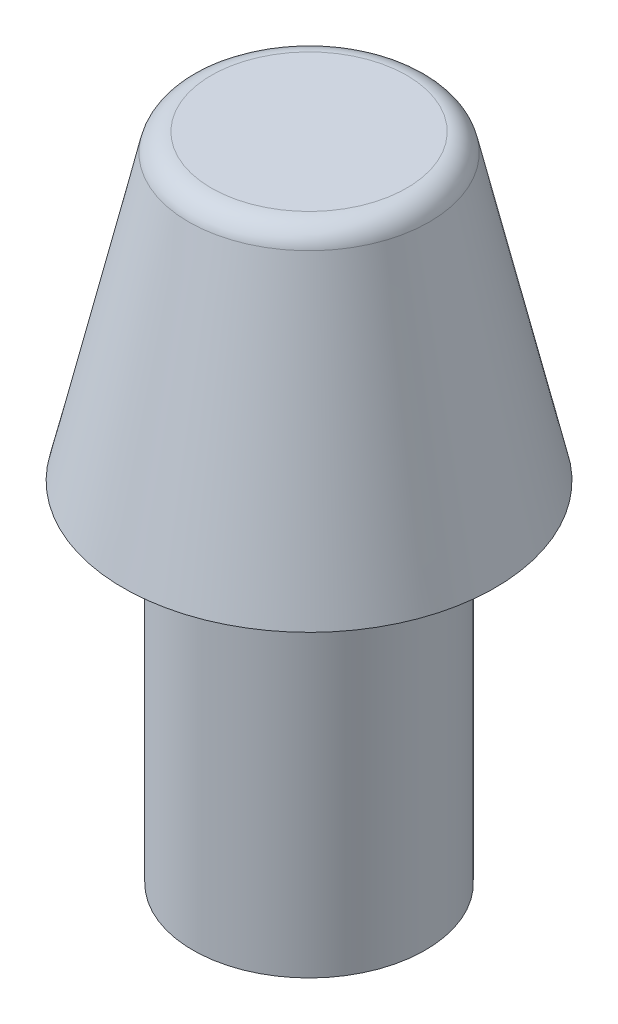
ISO-10303-21;
HEADER;
FILE_DESCRIPTION(('STEP AP214'),'2;1');
FILE_NAME('part.step','',(''),(''),'','','');
FILE_SCHEMA(('AUTOMOTIVE_DESIGN { 1 0 10303 214 1 1 1 1 }'));
ENDSEC;
DATA;
#1=APPLICATION_CONTEXT('core data for automotive mechanical design processes');
#2=APPLICATION_PROTOCOL_DEFINITION('international standard','automotive_design',2000,#1);
#3=PRODUCT_CONTEXT('',#1,'mechanical');
#4=PRODUCT('Part','Part','',(#3));
#5=PRODUCT_RELATED_PRODUCT_CATEGORY('part','',(#4));
#6=PRODUCT_DEFINITION_FORMATION('','',#4);
#7=PRODUCT_DEFINITION_CONTEXT('part definition',#1,'design');
#8=PRODUCT_DEFINITION('design','',#6,#7);
#9=PRODUCT_DEFINITION_SHAPE('','',#8);
#10=(LENGTH_UNIT() NAMED_UNIT(*) SI_UNIT(.MILLI.,.METRE.));
#11=(NAMED_UNIT(*) PLANE_ANGLE_UNIT() SI_UNIT($,.RADIAN.));
#12=(NAMED_UNIT(*) SI_UNIT($,.STERADIAN.) SOLID_ANGLE_UNIT());
#13=UNCERTAINTY_MEASURE_WITH_UNIT(LENGTH_MEASURE(1.E-05),#10,'distance_accuracy_value','');
#14=(GEOMETRIC_REPRESENTATION_CONTEXT(3) GLOBAL_UNCERTAINTY_ASSIGNED_CONTEXT((#13)) GLOBAL_UNIT_ASSIGNED_CONTEXT((#10,
#11,#12)) REPRESENTATION_CONTEXT('',''));
#15=CARTESIAN_POINT('',(0.,0.,0.));
#16=DIRECTION('',(0.,0.,1.));
#17=DIRECTION('',(1.,0.,0.));
#18=AXIS2_PLACEMENT_3D('',#15,#16,#17);
#19=CARTESIAN_POINT('',(0.,0.,0.));
#20=DIRECTION('',(0.,-1.,0.));
#21=DIRECTION('',(0.,0.,-1.));
#22=AXIS2_PLACEMENT_3D('',#19,#20,#21);
#23=PLANE('',#22);
#24=CARTESIAN_POINT('',(0.,0.,0.));
#25=DIRECTION('',(0.,-1.,0.));
#26=DIRECTION('',(0.,0.,-1.));
#27=AXIS2_PLACEMENT_3D('',#24,#25,#26);
#28=CIRCLE('',#27,1.25);
#29=CARTESIAN_POINT('',(0.,0.,-1.25));
#30=VERTEX_POINT('',#29);
#31=EDGE_CURVE('E60',#30,#30,#28,.T.);
#32=ORIENTED_EDGE('',*,*,#31,.T.);
#33=EDGE_LOOP('',(#32));
#34=FACE_BOUND('',#33,.T.);
#35=ADVANCED_FACE('F37',(#34),#23,.T.);
#36=CARTESIAN_POINT('',(0.,7.,0.));
#37=DIRECTION('',(0.,1.,0.));
#38=DIRECTION('',(0.,0.,1.));
#39=AXIS2_PLACEMENT_3D('',#36,#37,#38);
#40=PLANE('',#39);
#41=CARTESIAN_POINT('',(0.,7.,0.));
#42=DIRECTION('',(0.,-1.,0.));
#43=DIRECTION('',(0.,0.,-1.));
#44=AXIS2_PLACEMENT_3D('',#41,#42,#43);
#45=CIRCLE('',#44,1.05112184492065);
#46=CARTESIAN_POINT('',(0.,7.,-1.05112184492065));
#47=VERTEX_POINT('',#46);
#48=EDGE_CURVE('E10',#47,#47,#45,.T.);
#49=ORIENTED_EDGE('',*,*,#48,.F.);
#50=EDGE_LOOP('',(#49));
#51=FACE_BOUND('',#50,.T.);
#52=ADVANCED_FACE('F78',(#51),#40,.T.);
#53=CARTESIAN_POINT('',(0.,6.75,0.));
#54=DIRECTION('',(0.,-1.,0.));
#55=DIRECTION('',(0.,0.,-1.));
#56=AXIS2_PLACEMENT_3D('',#53,#54,#55);
#57=TOROIDAL_SURFACE('',#56,1.05112184492065,0.25);
#58=ORIENTED_EDGE('',*,*,#48,.T.);
#59=EDGE_LOOP('',(#58));
#60=FACE_BOUND('',#59,.T.);
#61=CARTESIAN_POINT('',(0.,6.80621487667469,0.));
#62=DIRECTION('',(0.,-1.,0.));
#63=DIRECTION('',(0.,0.,-1.));
#64=AXIS2_PLACEMENT_3D('',#61,#62,#63);
#65=CIRCLE('',#64,1.2947196438443);
#66=CARTESIAN_POINT('',(0.,6.80621487667469,-1.2947196438443));
#67=VERTEX_POINT('',#66);
#68=EDGE_CURVE('E44',#67,#67,#65,.T.);
#69=ORIENTED_EDGE('',*,*,#68,.F.);
#70=EDGE_LOOP('',(#69));
#71=FACE_BOUND('',#70,.T.);
#72=ADVANCED_FACE('F82',(#60,#71),#57,.T.);
#73=CARTESIAN_POINT('',(0.,3.75,0.));
#74=DIRECTION('',(0.,-1.,0.));
#75=DIRECTION('',(0.,0.,-1.));
#76=AXIS2_PLACEMENT_3D('',#73,#74,#75);
#77=CONICAL_SURFACE('',#76,2.,0.226798848053886);
#78=ORIENTED_EDGE('',*,*,#68,.T.);
#79=EDGE_LOOP('',(#78));
#80=FACE_BOUND('',#79,.T.);
#81=CARTESIAN_POINT('',(0.,3.75,0.));
#82=DIRECTION('',(0.,-1.,0.));
#83=DIRECTION('',(0.,0.,-1.));
#84=AXIS2_PLACEMENT_3D('',#81,#82,#83);
#85=CIRCLE('',#84,2.);
#86=CARTESIAN_POINT('',(0.,3.75,-2.));
#87=VERTEX_POINT('',#86);
#88=EDGE_CURVE('E49',#87,#87,#85,.T.);
#89=ORIENTED_EDGE('',*,*,#88,.F.);
#90=EDGE_LOOP('',(#89));
#91=FACE_BOUND('',#90,.T.);
#92=ADVANCED_FACE('F74',(#80,#91),#77,.T.);
#93=CARTESIAN_POINT('',(1.25,3.75,0.));
#94=DIRECTION('',(0.,-1.,0.));
#95=DIRECTION('',(0.,0.,-1.));
#96=AXIS2_PLACEMENT_3D('',#93,#94,#95);
#97=PLANE('',#96);
#98=ORIENTED_EDGE('',*,*,#88,.T.);
#99=EDGE_LOOP('',(#98));
#100=FACE_BOUND('',#99,.T.);
#101=CARTESIAN_POINT('',(0.,3.75,0.));
#102=DIRECTION('',(0.,-1.,0.));
#103=DIRECTION('',(0.,0.,-1.));
#104=AXIS2_PLACEMENT_3D('',#101,#102,#103);
#105=CIRCLE('',#104,1.25);
#106=CARTESIAN_POINT('',(0.,3.75,-1.25));
#107=VERTEX_POINT('',#106);
#108=EDGE_CURVE('E54',#107,#107,#105,.T.);
#109=ORIENTED_EDGE('',*,*,#108,.F.);
#110=EDGE_LOOP('',(#109));
#111=FACE_BOUND('',#110,.T.);
#112=ADVANCED_FACE('F68',(#100,#111),#97,.T.);
#113=CARTESIAN_POINT('',(0.,0.,0.));
#114=DIRECTION('',(0.,-1.,0.));
#115=DIRECTION('',(0.,0.,-1.));
#116=AXIS2_PLACEMENT_3D('',#113,#114,#115);
#117=CYLINDRICAL_SURFACE('',#116,1.25);
#118=ORIENTED_EDGE('',*,*,#108,.T.);
#119=EDGE_LOOP('',(#118));
#120=FACE_BOUND('',#119,.T.);
#121=ORIENTED_EDGE('',*,*,#31,.F.);
#122=EDGE_LOOP('',(#121));
#123=FACE_BOUND('',#122,.T.);
#124=ADVANCED_FACE('F66',(#120,#123),#117,.T.);
#125=CLOSED_SHELL('',(#35,#52,#72,#92,#112,#124));
#126=MANIFOLD_SOLID_BREP('B2',#125);
#127=ADVANCED_BREP_SHAPE_REPRESENTATION('',(#18,#126),#14);
#128=SHAPE_DEFINITION_REPRESENTATION(#9,#127);
ENDSEC;
END-ISO-10303-21;
